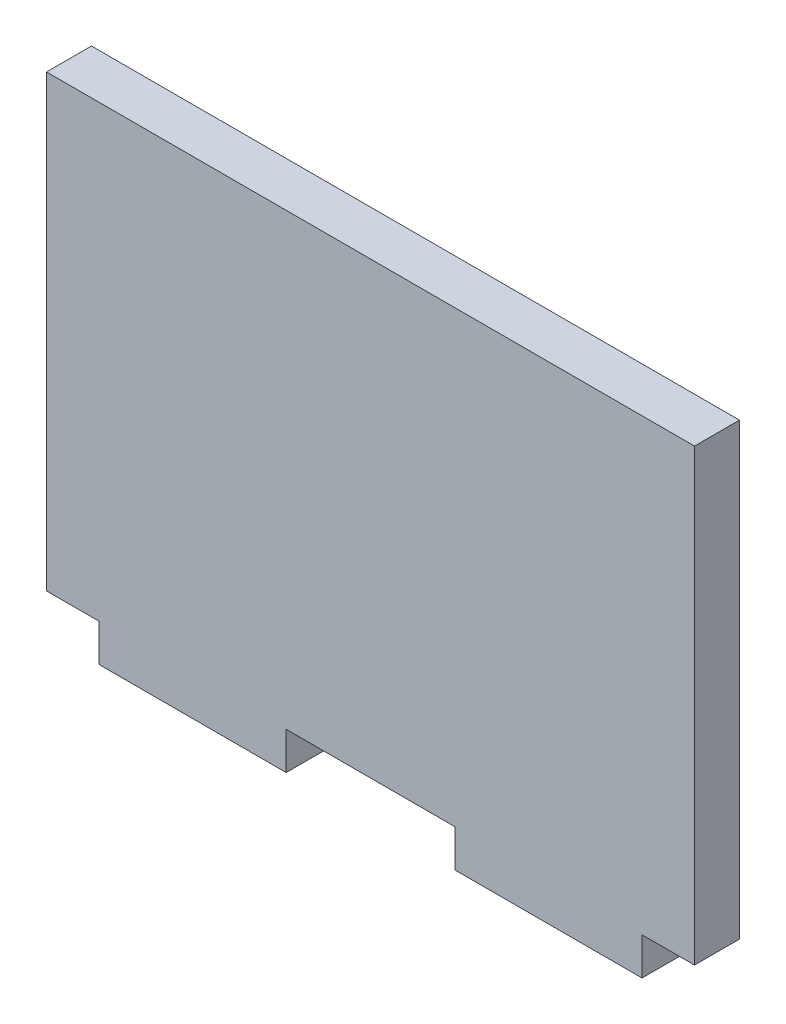
ISO-10303-21;
HEADER;
FILE_DESCRIPTION(('STEP AP214'),'2;1');
FILE_NAME('part.step','',(''),(''),'','','');
FILE_SCHEMA(('AUTOMOTIVE_DESIGN { 1 0 10303 214 1 1 1 1 }'));
ENDSEC;
DATA;
#1=APPLICATION_CONTEXT('core data for automotive mechanical design processes');
#2=APPLICATION_PROTOCOL_DEFINITION('international standard','automotive_design',2000,#1);
#3=PRODUCT_CONTEXT('',#1,'mechanical');
#4=PRODUCT('Part','Part','',(#3));
#5=PRODUCT_RELATED_PRODUCT_CATEGORY('part','',(#4));
#6=PRODUCT_DEFINITION_FORMATION('','',#4);
#7=PRODUCT_DEFINITION_CONTEXT('part definition',#1,'design');
#8=PRODUCT_DEFINITION('design','',#6,#7);
#9=PRODUCT_DEFINITION_SHAPE('','',#8);
#10=(LENGTH_UNIT() NAMED_UNIT(*) SI_UNIT(.MILLI.,.METRE.));
#11=(NAMED_UNIT(*) PLANE_ANGLE_UNIT() SI_UNIT($,.RADIAN.));
#12=(NAMED_UNIT(*) SI_UNIT($,.STERADIAN.) SOLID_ANGLE_UNIT());
#13=UNCERTAINTY_MEASURE_WITH_UNIT(LENGTH_MEASURE(1.E-05),#10,'distance_accuracy_value','');
#14=(GEOMETRIC_REPRESENTATION_CONTEXT(3) GLOBAL_UNCERTAINTY_ASSIGNED_CONTEXT((#13)) GLOBAL_UNIT_ASSIGNED_CONTEXT((#10,
#11,#12)) REPRESENTATION_CONTEXT('',''));
#15=CARTESIAN_POINT('',(0.,0.,0.));
#16=DIRECTION('',(0.,0.,1.));
#17=DIRECTION('',(1.,0.,0.));
#18=AXIS2_PLACEMENT_3D('',#15,#16,#17);
#19=CARTESIAN_POINT('',(59.9869248741913,0.,6.));
#20=DIRECTION('',(1.,0.,0.));
#21=DIRECTION('',(0.,1.,0.));
#22=AXIS2_PLACEMENT_3D('',#19,#20,#21);
#23=PLANE('',#22);
#24=DIRECTION('',(0.,-1.,0.));
#25=VECTOR('',#24,1.);
#26=CARTESIAN_POINT('',(59.9869248741913,0.,0.));
#27=LINE('',#26,#25);
#28=CARTESIAN_POINT('',(59.9869248741912,55.7692307692308,0.));
#29=VERTEX_POINT('',#28);
#30=CARTESIAN_POINT('',(59.9869248741913,-4.23076923076923,0.));
#31=VERTEX_POINT('',#30);
#32=EDGE_CURVE('E153',#29,#31,#27,.T.);
#33=ORIENTED_EDGE('',*,*,#32,.F.);
#34=DIRECTION('',(0.,0.,-1.));
#35=VECTOR('',#34,1.);
#36=CARTESIAN_POINT('',(59.9869248741912,55.7692307692308,6.));
#37=LINE('',#36,#35);
#38=CARTESIAN_POINT('',(59.9869248741912,55.7692307692308,6.));
#39=VERTEX_POINT('',#38);
#40=EDGE_CURVE('E11',#39,#29,#37,.T.);
#41=ORIENTED_EDGE('',*,*,#40,.F.);
#42=DIRECTION('',(0.,-1.,0.));
#43=VECTOR('',#42,1.);
#44=CARTESIAN_POINT('',(59.9869248741913,0.,6.));
#45=LINE('',#44,#43);
#46=CARTESIAN_POINT('',(59.9869248741913,-4.23076923076923,6.));
#47=VERTEX_POINT('',#46);
#48=EDGE_CURVE('E212',#39,#47,#45,.T.);
#49=ORIENTED_EDGE('',*,*,#48,.T.);
#50=DIRECTION('',(0.,0.,-1.));
#51=VECTOR('',#50,1.);
#52=CARTESIAN_POINT('',(59.9869248741913,-4.23076923076923,6.));
#53=LINE('',#52,#51);
#54=EDGE_CURVE('E96',#47,#31,#53,.T.);
#55=ORIENTED_EDGE('',*,*,#54,.T.);
#56=EDGE_LOOP('',(#33,#41,#49,#55));
#57=FACE_BOUND('',#56,.T.);
#58=ADVANCED_FACE('F34',(#57),#23,.T.);
#59=CARTESIAN_POINT('',(0.,55.7692307692308,6.));
#60=DIRECTION('',(0.,1.,0.));
#61=DIRECTION('',(-1.,0.,0.));
#62=AXIS2_PLACEMENT_3D('',#59,#60,#61);
#63=PLANE('',#62);
#64=DIRECTION('',(1.,0.,0.));
#65=VECTOR('',#64,1.);
#66=CARTESIAN_POINT('',(0.,55.7692307692308,0.));
#67=LINE('',#66,#65);
#68=CARTESIAN_POINT('',(-26.5130751258088,55.7692307692308,0.));
#69=VERTEX_POINT('',#68);
#70=EDGE_CURVE('E156',#69,#29,#67,.T.);
#71=ORIENTED_EDGE('',*,*,#70,.F.);
#72=DIRECTION('',(0.,0.,-1.));
#73=VECTOR('',#72,1.);
#74=CARTESIAN_POINT('',(-26.5130751258088,55.7692307692308,6.));
#75=LINE('',#74,#73);
#76=CARTESIAN_POINT('',(-26.5130751258088,55.7692307692308,6.));
#77=VERTEX_POINT('',#76);
#78=EDGE_CURVE('E42',#77,#69,#75,.T.);
#79=ORIENTED_EDGE('',*,*,#78,.F.);
#80=DIRECTION('',(1.,0.,0.));
#81=VECTOR('',#80,1.);
#82=CARTESIAN_POINT('',(0.,55.7692307692308,6.));
#83=LINE('',#82,#81);
#84=EDGE_CURVE('E211',#77,#39,#83,.T.);
#85=ORIENTED_EDGE('',*,*,#84,.T.);
#86=ORIENTED_EDGE('',*,*,#40,.T.);
#87=EDGE_LOOP('',(#71,#79,#85,#86));
#88=FACE_BOUND('',#87,.T.);
#89=ADVANCED_FACE('F210',(#88),#63,.T.);
#90=CARTESIAN_POINT('',(-26.5130751258087,0.,6.));
#91=DIRECTION('',(1.,0.,0.));
#92=DIRECTION('',(0.,1.,0.));
#93=AXIS2_PLACEMENT_3D('',#90,#91,#92);
#94=PLANE('',#93);
#95=DIRECTION('',(0.,-1.,0.));
#96=VECTOR('',#95,1.);
#97=CARTESIAN_POINT('',(-26.5130751258087,0.,0.));
#98=LINE('',#97,#96);
#99=CARTESIAN_POINT('',(-26.5130751258087,-4.23076923076923,0.));
#100=VERTEX_POINT('',#99);
#101=EDGE_CURVE('E159',#69,#100,#98,.T.);
#102=ORIENTED_EDGE('',*,*,#101,.T.);
#103=DIRECTION('',(0.,0.,-1.));
#104=VECTOR('',#103,1.);
#105=CARTESIAN_POINT('',(-26.5130751258087,-4.23076923076923,6.));
#106=LINE('',#105,#104);
#107=CARTESIAN_POINT('',(-26.5130751258087,-4.23076923076923,6.));
#108=VERTEX_POINT('',#107);
#109=EDGE_CURVE('E194',#108,#100,#106,.T.);
#110=ORIENTED_EDGE('',*,*,#109,.F.);
#111=DIRECTION('',(0.,-1.,0.));
#112=VECTOR('',#111,1.);
#113=CARTESIAN_POINT('',(-26.5130751258087,0.,6.));
#114=LINE('',#113,#112);
#115=EDGE_CURVE('E201',#77,#108,#114,.T.);
#116=ORIENTED_EDGE('',*,*,#115,.F.);
#117=ORIENTED_EDGE('',*,*,#78,.T.);
#118=EDGE_LOOP('',(#102,#110,#116,#117));
#119=FACE_BOUND('',#118,.T.);
#120=ADVANCED_FACE('F199',(#119),#94,.F.);
#121=CARTESIAN_POINT('',(0.,-4.23076923076923,6.));
#122=DIRECTION('',(0.,1.,0.));
#123=DIRECTION('',(-1.,0.,0.));
#124=AXIS2_PLACEMENT_3D('',#121,#122,#123);
#125=PLANE('',#124);
#126=DIRECTION('',(1.,0.,0.));
#127=VECTOR('',#126,1.);
#128=CARTESIAN_POINT('',(0.,-4.23076923076923,0.));
#129=LINE('',#128,#127);
#130=CARTESIAN_POINT('',(-19.5030751258087,-4.23076923076923,0.));
#131=VERTEX_POINT('',#130);
#132=EDGE_CURVE('E161',#100,#131,#129,.T.);
#133=ORIENTED_EDGE('',*,*,#132,.T.);
#134=DIRECTION('',(0.,0.,-1.));
#135=VECTOR('',#134,1.);
#136=CARTESIAN_POINT('',(-19.5030751258087,-4.23076923076923,6.));
#137=LINE('',#136,#135);
#138=CARTESIAN_POINT('',(-19.5030751258087,-4.23076923076923,6.));
#139=VERTEX_POINT('',#138);
#140=EDGE_CURVE('E191',#139,#131,#137,.T.);
#141=ORIENTED_EDGE('',*,*,#140,.F.);
#142=DIRECTION('',(1.,0.,0.));
#143=VECTOR('',#142,1.);
#144=CARTESIAN_POINT('',(0.,-4.23076923076923,6.));
#145=LINE('',#144,#143);
#146=EDGE_CURVE('E150',#108,#139,#145,.T.);
#147=ORIENTED_EDGE('',*,*,#146,.F.);
#148=ORIENTED_EDGE('',*,*,#109,.T.);
#149=EDGE_LOOP('',(#133,#141,#147,#148));
#150=FACE_BOUND('',#149,.T.);
#151=ADVANCED_FACE('F235',(#150),#125,.F.);
#152=CARTESIAN_POINT('',(-19.5030751258087,0.,6.));
#153=DIRECTION('',(1.,0.,0.));
#154=DIRECTION('',(0.,1.,0.));
#155=AXIS2_PLACEMENT_3D('',#152,#153,#154);
#156=PLANE('',#155);
#157=DIRECTION('',(0.,-1.,0.));
#158=VECTOR('',#157,1.);
#159=CARTESIAN_POINT('',(-19.5030751258087,0.,0.));
#160=LINE('',#159,#158);
#161=CARTESIAN_POINT('',(-19.5030751258087,-9.23076923076923,0.));
#162=VERTEX_POINT('',#161);
#163=EDGE_CURVE('E163',#131,#162,#160,.T.);
#164=ORIENTED_EDGE('',*,*,#163,.T.);
#165=DIRECTION('',(0.,0.,-1.));
#166=VECTOR('',#165,1.);
#167=CARTESIAN_POINT('',(-19.5030751258087,-9.23076923076923,6.));
#168=LINE('',#167,#166);
#169=CARTESIAN_POINT('',(-19.5030751258087,-9.23076923076923,6.));
#170=VERTEX_POINT('',#169);
#171=EDGE_CURVE('E188',#170,#162,#168,.T.);
#172=ORIENTED_EDGE('',*,*,#171,.F.);
#173=DIRECTION('',(0.,-1.,0.));
#174=VECTOR('',#173,1.);
#175=CARTESIAN_POINT('',(-19.5030751258087,0.,6.));
#176=LINE('',#175,#174);
#177=EDGE_CURVE('E229',#139,#170,#176,.T.);
#178=ORIENTED_EDGE('',*,*,#177,.F.);
#179=ORIENTED_EDGE('',*,*,#140,.T.);
#180=EDGE_LOOP('',(#164,#172,#178,#179));
#181=FACE_BOUND('',#180,.T.);
#182=ADVANCED_FACE('F239',(#181),#156,.F.);
#183=CARTESIAN_POINT('',(0.,-9.23076923076923,6.));
#184=DIRECTION('',(0.,1.,0.));
#185=DIRECTION('',(0.,0.,1.));
#186=AXIS2_PLACEMENT_3D('',#183,#184,#185);
#187=PLANE('',#186);
#188=DIRECTION('',(1.,0.,0.));
#189=VECTOR('',#188,1.);
#190=CARTESIAN_POINT('',(0.,-9.23076923076923,0.));
#191=LINE('',#190,#189);
#192=CARTESIAN_POINT('',(5.47692487419125,-9.23076923076923,0.));
#193=VERTEX_POINT('',#192);
#194=EDGE_CURVE('E167',#162,#193,#191,.T.);
#195=ORIENTED_EDGE('',*,*,#194,.T.);
#196=DIRECTION('',(0.,0.,-1.));
#197=VECTOR('',#196,1.);
#198=CARTESIAN_POINT('',(5.47692487419125,-9.23076923076923,6.));
#199=LINE('',#198,#197);
#200=CARTESIAN_POINT('',(5.47692487419125,-9.23076923076923,6.));
#201=VERTEX_POINT('',#200);
#202=EDGE_CURVE('E186',#201,#193,#199,.T.);
#203=ORIENTED_EDGE('',*,*,#202,.F.);
#204=DIRECTION('',(1.,0.,0.));
#205=VECTOR('',#204,1.);
#206=CARTESIAN_POINT('',(0.,-9.23076923076923,6.));
#207=LINE('',#206,#205);
#208=EDGE_CURVE('E227',#170,#201,#207,.T.);
#209=ORIENTED_EDGE('',*,*,#208,.F.);
#210=ORIENTED_EDGE('',*,*,#171,.T.);
#211=EDGE_LOOP('',(#195,#203,#209,#210));
#212=FACE_BOUND('',#211,.T.);
#213=ADVANCED_FACE('F244',(#212),#187,.F.);
#214=CARTESIAN_POINT('',(5.47692487419125,0.,6.));
#215=DIRECTION('',(1.,0.,0.));
#216=DIRECTION('',(0.,0.,-1.));
#217=AXIS2_PLACEMENT_3D('',#214,#215,#216);
#218=PLANE('',#217);
#219=DIRECTION('',(0.,-1.,0.));
#220=VECTOR('',#219,1.);
#221=CARTESIAN_POINT('',(5.47692487419125,0.,0.));
#222=LINE('',#221,#220);
#223=CARTESIAN_POINT('',(5.47692487419125,-4.23076923076923,0.));
#224=VERTEX_POINT('',#223);
#225=EDGE_CURVE('E170',#224,#193,#222,.T.);
#226=ORIENTED_EDGE('',*,*,#225,.F.);
#227=DIRECTION('',(0.,0.,-1.));
#228=VECTOR('',#227,1.);
#229=CARTESIAN_POINT('',(5.47692487419125,-4.23076923076923,6.));
#230=LINE('',#229,#228);
#231=CARTESIAN_POINT('',(5.47692487419125,-4.23076923076923,6.));
#232=VERTEX_POINT('',#231);
#233=EDGE_CURVE('E184',#232,#224,#230,.T.);
#234=ORIENTED_EDGE('',*,*,#233,.F.);
#235=DIRECTION('',(0.,-1.,0.));
#236=VECTOR('',#235,1.);
#237=CARTESIAN_POINT('',(5.47692487419125,0.,6.));
#238=LINE('',#237,#236);
#239=EDGE_CURVE('E223',#232,#201,#238,.T.);
#240=ORIENTED_EDGE('',*,*,#239,.T.);
#241=ORIENTED_EDGE('',*,*,#202,.T.);
#242=EDGE_LOOP('',(#226,#234,#240,#241));
#243=FACE_BOUND('',#242,.T.);
#244=ADVANCED_FACE('F247',(#243),#218,.T.);
#245=CARTESIAN_POINT('',(27.9969248741913,-4.23076923076923,0.));
#246=VERTEX_POINT('',#245);
#247=EDGE_CURVE('E165',#224,#246,#129,.T.);
#248=ORIENTED_EDGE('',*,*,#247,.T.);
#249=DIRECTION('',(0.,0.,-1.));
#250=VECTOR('',#249,1.);
#251=CARTESIAN_POINT('',(27.9969248741913,-4.23076923076923,6.));
#252=LINE('',#251,#250);
#253=CARTESIAN_POINT('',(27.9969248741913,-4.23076923076923,6.));
#254=VERTEX_POINT('',#253);
#255=EDGE_CURVE('E181',#254,#246,#252,.T.);
#256=ORIENTED_EDGE('',*,*,#255,.F.);
#257=EDGE_CURVE('E149',#232,#254,#145,.T.);
#258=ORIENTED_EDGE('',*,*,#257,.F.);
#259=ORIENTED_EDGE('',*,*,#233,.T.);
#260=EDGE_LOOP('',(#248,#256,#258,#259));
#261=FACE_BOUND('',#260,.T.);
#262=ADVANCED_FACE('F217',(#261),#125,.F.);
#263=CARTESIAN_POINT('',(27.9969248741913,0.,6.));
#264=DIRECTION('',(1.,0.,0.));
#265=DIRECTION('',(0.,1.,0.));
#266=AXIS2_PLACEMENT_3D('',#263,#264,#265);
#267=PLANE('',#266);
#268=DIRECTION('',(0.,-1.,0.));
#269=VECTOR('',#268,1.);
#270=CARTESIAN_POINT('',(27.9969248741913,0.,0.));
#271=LINE('',#270,#269);
#272=CARTESIAN_POINT('',(27.9969248741913,-9.23076923076923,0.));
#273=VERTEX_POINT('',#272);
#274=EDGE_CURVE('E173',#246,#273,#271,.T.);
#275=ORIENTED_EDGE('',*,*,#274,.T.);
#276=DIRECTION('',(0.,0.,-1.));
#277=VECTOR('',#276,1.);
#278=CARTESIAN_POINT('',(27.9969248741913,-9.23076923076923,6.));
#279=LINE('',#278,#277);
#280=CARTESIAN_POINT('',(27.9969248741913,-9.23076923076923,6.));
#281=VERTEX_POINT('',#280);
#282=EDGE_CURVE('E144',#281,#273,#279,.T.);
#283=ORIENTED_EDGE('',*,*,#282,.F.);
#284=DIRECTION('',(0.,-1.,0.));
#285=VECTOR('',#284,1.);
#286=CARTESIAN_POINT('',(27.9969248741913,0.,6.));
#287=LINE('',#286,#285);
#288=EDGE_CURVE('E131',#254,#281,#287,.T.);
#289=ORIENTED_EDGE('',*,*,#288,.F.);
#290=ORIENTED_EDGE('',*,*,#255,.T.);
#291=EDGE_LOOP('',(#275,#283,#289,#290));
#292=FACE_BOUND('',#291,.T.);
#293=ADVANCED_FACE('F222',(#292),#267,.F.);
#294=CARTESIAN_POINT('',(0.,-9.23076923076922,6.));
#295=DIRECTION('',(0.,1.,0.));
#296=DIRECTION('',(-1.,0.,0.));
#297=AXIS2_PLACEMENT_3D('',#294,#295,#296);
#298=PLANE('',#297);
#299=DIRECTION('',(1.,0.,0.));
#300=VECTOR('',#299,1.);
#301=CARTESIAN_POINT('',(0.,-9.23076923076922,0.));
#302=LINE('',#301,#300);
#303=CARTESIAN_POINT('',(52.9769248741913,-9.23076923076923,0.));
#304=VERTEX_POINT('',#303);
#305=EDGE_CURVE('E140',#273,#304,#302,.T.);
#306=ORIENTED_EDGE('',*,*,#305,.T.);
#307=DIRECTION('',(0.,0.,-1.));
#308=VECTOR('',#307,1.);
#309=CARTESIAN_POINT('',(52.9769248741913,-9.23076923076923,6.));
#310=LINE('',#309,#308);
#311=CARTESIAN_POINT('',(52.9769248741913,-9.23076923076923,6.));
#312=VERTEX_POINT('',#311);
#313=EDGE_CURVE('E137',#312,#304,#310,.T.);
#314=ORIENTED_EDGE('',*,*,#313,.F.);
#315=DIRECTION('',(1.,0.,0.));
#316=VECTOR('',#315,1.);
#317=CARTESIAN_POINT('',(0.,-9.23076923076922,6.));
#318=LINE('',#317,#316);
#319=EDGE_CURVE('E125',#281,#312,#318,.T.);
#320=ORIENTED_EDGE('',*,*,#319,.F.);
#321=ORIENTED_EDGE('',*,*,#282,.T.);
#322=EDGE_LOOP('',(#306,#314,#320,#321));
#323=FACE_BOUND('',#322,.T.);
#324=ADVANCED_FACE('F138',(#323),#298,.F.);
#325=CARTESIAN_POINT('',(52.9769248741913,0.,6.));
#326=DIRECTION('',(1.,0.,0.));
#327=DIRECTION('',(0.,0.,-1.));
#328=AXIS2_PLACEMENT_3D('',#325,#326,#327);
#329=PLANE('',#328);
#330=DIRECTION('',(0.,-1.,0.));
#331=VECTOR('',#330,1.);
#332=CARTESIAN_POINT('',(52.9769248741913,0.,0.));
#333=LINE('',#332,#331);
#334=CARTESIAN_POINT('',(52.9769248741913,-4.23076923076923,0.));
#335=VERTEX_POINT('',#334);
#336=EDGE_CURVE('E176',#335,#304,#333,.T.);
#337=ORIENTED_EDGE('',*,*,#336,.F.);
#338=DIRECTION('',(0.,0.,-1.));
#339=VECTOR('',#338,1.);
#340=CARTESIAN_POINT('',(52.9769248741913,-4.23076923076923,6.));
#341=LINE('',#340,#339);
#342=CARTESIAN_POINT('',(52.9769248741913,-4.23076923076923,6.));
#343=VERTEX_POINT('',#342);
#344=EDGE_CURVE('E89',#343,#335,#341,.T.);
#345=ORIENTED_EDGE('',*,*,#344,.F.);
#346=DIRECTION('',(0.,-1.,0.));
#347=VECTOR('',#346,1.);
#348=CARTESIAN_POINT('',(52.9769248741913,0.,6.));
#349=LINE('',#348,#347);
#350=EDGE_CURVE('E129',#343,#312,#349,.T.);
#351=ORIENTED_EDGE('',*,*,#350,.T.);
#352=ORIENTED_EDGE('',*,*,#313,.T.);
#353=EDGE_LOOP('',(#337,#345,#351,#352));
#354=FACE_BOUND('',#353,.T.);
#355=ADVANCED_FACE('F146',(#354),#329,.T.);
#356=EDGE_CURVE('E164',#335,#31,#129,.T.);
#357=ORIENTED_EDGE('',*,*,#356,.T.);
#358=ORIENTED_EDGE('',*,*,#54,.F.);
#359=EDGE_CURVE('E50',#343,#47,#145,.T.);
#360=ORIENTED_EDGE('',*,*,#359,.F.);
#361=ORIENTED_EDGE('',*,*,#344,.T.);
#362=EDGE_LOOP('',(#357,#358,#360,#361));
#363=FACE_BOUND('',#362,.T.);
#364=ADVANCED_FACE('F255',(#363),#125,.F.);
#365=CARTESIAN_POINT('',(0.,0.,6.));
#366=DIRECTION('',(0.,0.,1.));
#367=DIRECTION('',(1.,0.,0.));
#368=AXIS2_PLACEMENT_3D('',#365,#366,#367);
#369=PLANE('',#368);
#370=ORIENTED_EDGE('',*,*,#48,.F.);
#371=ORIENTED_EDGE('',*,*,#84,.F.);
#372=ORIENTED_EDGE('',*,*,#115,.T.);
#373=ORIENTED_EDGE('',*,*,#146,.T.);
#374=ORIENTED_EDGE('',*,*,#177,.T.);
#375=ORIENTED_EDGE('',*,*,#208,.T.);
#376=ORIENTED_EDGE('',*,*,#239,.F.);
#377=ORIENTED_EDGE('',*,*,#257,.T.);
#378=ORIENTED_EDGE('',*,*,#288,.T.);
#379=ORIENTED_EDGE('',*,*,#319,.T.);
#380=ORIENTED_EDGE('',*,*,#350,.F.);
#381=ORIENTED_EDGE('',*,*,#359,.T.);
#382=EDGE_LOOP('',(#370,#371,#372,#373,#374,#375,#376,#377,#378,#379,#380,#381));
#383=FACE_BOUND('',#382,.T.);
#384=ADVANCED_FACE('F127',(#383),#369,.T.);
#385=CARTESIAN_POINT('',(0.,0.,0.));
#386=DIRECTION('',(0.,0.,1.));
#387=DIRECTION('',(1.,0.,0.));
#388=AXIS2_PLACEMENT_3D('',#385,#386,#387);
#389=PLANE('',#388);
#390=ORIENTED_EDGE('',*,*,#32,.T.);
#391=ORIENTED_EDGE('',*,*,#356,.F.);
#392=ORIENTED_EDGE('',*,*,#336,.T.);
#393=ORIENTED_EDGE('',*,*,#305,.F.);
#394=ORIENTED_EDGE('',*,*,#274,.F.);
#395=ORIENTED_EDGE('',*,*,#247,.F.);
#396=ORIENTED_EDGE('',*,*,#225,.T.);
#397=ORIENTED_EDGE('',*,*,#194,.F.);
#398=ORIENTED_EDGE('',*,*,#163,.F.);
#399=ORIENTED_EDGE('',*,*,#132,.F.);
#400=ORIENTED_EDGE('',*,*,#101,.F.);
#401=ORIENTED_EDGE('',*,*,#70,.T.);
#402=EDGE_LOOP('',(#390,#391,#392,#393,#394,#395,#396,#397,#398,#399,#400,#401));
#403=FACE_BOUND('',#402,.T.);
#404=ADVANCED_FACE('F208',(#403),#389,.F.);
#405=CLOSED_SHELL('',(#58,#89,#120,#151,#182,#213,#244,#262,#293,#324,#355,#364,#384,#404));
#406=MANIFOLD_SOLID_BREP('B2',#405);
#407=ADVANCED_BREP_SHAPE_REPRESENTATION('',(#18,#406),#14);
#408=SHAPE_DEFINITION_REPRESENTATION(#9,#407);
ENDSEC;
END-ISO-10303-21;
